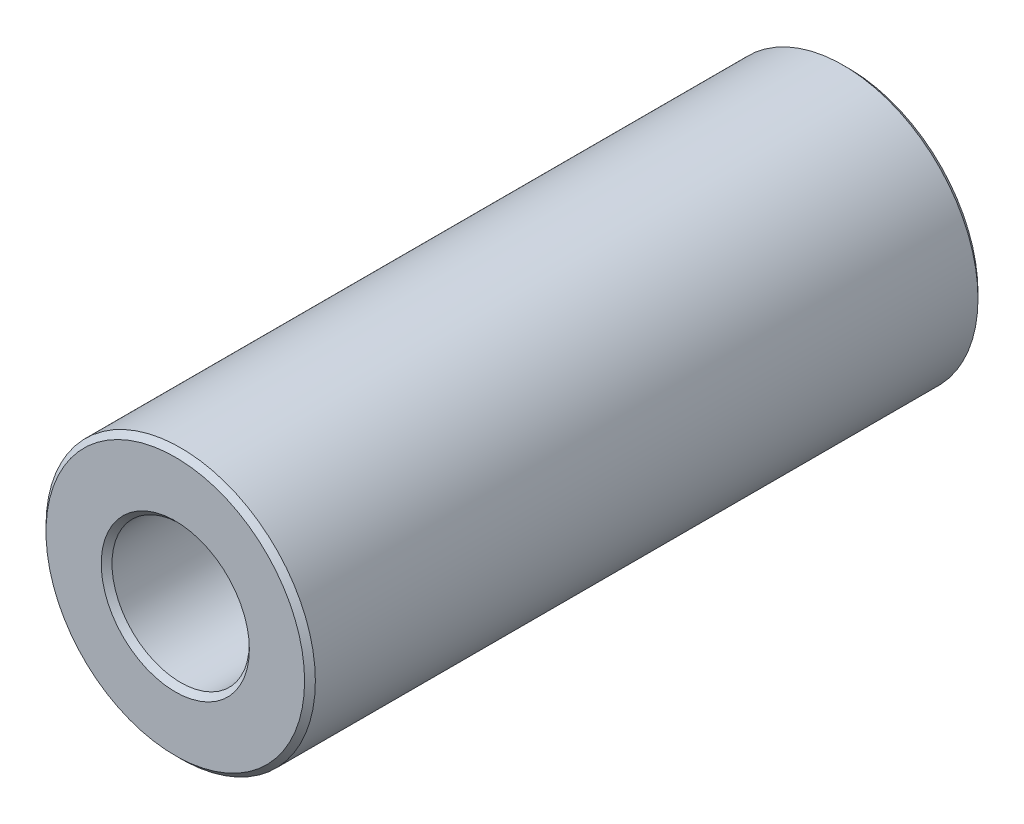
ISO-10303-21;
HEADER;
FILE_DESCRIPTION(('STEP AP214'),'2;1');
FILE_NAME('part.step','',(''),(''),'','','');
FILE_SCHEMA(('AUTOMOTIVE_DESIGN { 1 0 10303 214 1 1 1 1 }'));
ENDSEC;
DATA;
#1=APPLICATION_CONTEXT('core data for automotive mechanical design processes');
#2=APPLICATION_PROTOCOL_DEFINITION('international standard','automotive_design',2000,#1);
#3=PRODUCT_CONTEXT('',#1,'mechanical');
#4=PRODUCT('Part','Part','',(#3));
#5=PRODUCT_RELATED_PRODUCT_CATEGORY('part','',(#4));
#6=PRODUCT_DEFINITION_FORMATION('','',#4);
#7=PRODUCT_DEFINITION_CONTEXT('part definition',#1,'design');
#8=PRODUCT_DEFINITION('design','',#6,#7);
#9=PRODUCT_DEFINITION_SHAPE('','',#8);
#10=(LENGTH_UNIT() NAMED_UNIT(*) SI_UNIT(.MILLI.,.METRE.));
#11=(NAMED_UNIT(*) PLANE_ANGLE_UNIT() SI_UNIT($,.RADIAN.));
#12=(NAMED_UNIT(*) SI_UNIT($,.STERADIAN.) SOLID_ANGLE_UNIT());
#13=UNCERTAINTY_MEASURE_WITH_UNIT(LENGTH_MEASURE(1.E-05),#10,'distance_accuracy_value','');
#14=(GEOMETRIC_REPRESENTATION_CONTEXT(3) GLOBAL_UNCERTAINTY_ASSIGNED_CONTEXT((#13)) GLOBAL_UNIT_ASSIGNED_CONTEXT((#10,
#11,#12)) REPRESENTATION_CONTEXT('',''));
#15=CARTESIAN_POINT('',(0.,0.,0.));
#16=DIRECTION('',(0.,0.,1.));
#17=DIRECTION('',(1.,0.,0.));
#18=AXIS2_PLACEMENT_3D('',#15,#16,#17);
#19=CARTESIAN_POINT('',(0.,0.,25.));
#20=DIRECTION('',(0.,0.,1.));
#21=DIRECTION('',(1.,0.,0.));
#22=AXIS2_PLACEMENT_3D('',#19,#20,#21);
#23=PLANE('',#22);
#24=CARTESIAN_POINT('',(0.,0.,25.));
#25=DIRECTION('',(0.,0.,1.));
#26=DIRECTION('',(1.,0.,0.));
#27=AXIS2_PLACEMENT_3D('',#24,#25,#26);
#28=CIRCLE('',#27,2.75000000000001);
#29=CARTESIAN_POINT('',(2.75000000000001,0.,25.));
#30=VERTEX_POINT('',#29);
#31=EDGE_CURVE('E10',#30,#30,#28,.F.);
#32=ORIENTED_EDGE('',*,*,#31,.T.);
#33=EDGE_LOOP('',(#32));
#34=FACE_BOUND('',#33,.T.);
#35=CARTESIAN_POINT('',(0.,0.,25.));
#36=DIRECTION('',(0.,0.,1.));
#37=DIRECTION('',(1.,0.,0.));
#38=AXIS2_PLACEMENT_3D('',#35,#36,#37);
#39=CIRCLE('',#38,4.80000000000001);
#40=CARTESIAN_POINT('',(4.80000000000001,0.,25.));
#41=VERTEX_POINT('',#40);
#42=EDGE_CURVE('E37',#41,#41,#39,.T.);
#43=ORIENTED_EDGE('',*,*,#42,.T.);
#44=EDGE_LOOP('',(#43));
#45=FACE_BOUND('',#44,.T.);
#46=ADVANCED_FACE('F30',(#34,#45),#23,.T.);
#47=CARTESIAN_POINT('',(0.,0.,0.));
#48=DIRECTION('',(0.,0.,1.));
#49=DIRECTION('',(1.,0.,0.));
#50=AXIS2_PLACEMENT_3D('',#47,#48,#49);
#51=PLANE('',#50);
#52=CARTESIAN_POINT('',(0.,0.,0.));
#53=DIRECTION('',(0.,0.,1.));
#54=DIRECTION('',(1.,0.,0.));
#55=AXIS2_PLACEMENT_3D('',#52,#53,#54);
#56=CIRCLE('',#55,4.8);
#57=CARTESIAN_POINT('',(4.8,0.,0.));
#58=VERTEX_POINT('',#57);
#59=EDGE_CURVE('E50',#58,#58,#56,.F.);
#60=ORIENTED_EDGE('',*,*,#59,.T.);
#61=EDGE_LOOP('',(#60));
#62=FACE_BOUND('',#61,.T.);
#63=CARTESIAN_POINT('',(0.,0.,0.));
#64=DIRECTION('',(0.,0.,1.));
#65=DIRECTION('',(1.,0.,0.));
#66=AXIS2_PLACEMENT_3D('',#63,#64,#65);
#67=CIRCLE('',#66,2.75);
#68=CARTESIAN_POINT('',(2.75,0.,0.));
#69=VERTEX_POINT('',#68);
#70=EDGE_CURVE('E53',#69,#69,#67,.T.);
#71=ORIENTED_EDGE('',*,*,#70,.T.);
#72=EDGE_LOOP('',(#71));
#73=FACE_BOUND('',#72,.T.);
#74=ADVANCED_FACE('F74',(#62,#73),#51,.F.);
#75=CARTESIAN_POINT('',(0.,0.,25.));
#76=DIRECTION('',(0.,0.,-1.));
#77=DIRECTION('',(-1.,0.,0.));
#78=AXIS2_PLACEMENT_3D('',#75,#76,#77);
#79=CYLINDRICAL_SURFACE('',#78,5.);
#80=CARTESIAN_POINT('',(0.,0.,0.199999999999999));
#81=DIRECTION('',(0.,0.,1.));
#82=DIRECTION('',(1.,0.,0.));
#83=AXIS2_PLACEMENT_3D('',#80,#81,#82);
#84=CIRCLE('',#83,5.);
#85=CARTESIAN_POINT('',(5.,0.,0.199999999999999));
#86=VERTEX_POINT('',#85);
#87=EDGE_CURVE('E56',#86,#86,#84,.T.);
#88=ORIENTED_EDGE('',*,*,#87,.T.);
#89=EDGE_LOOP('',(#88));
#90=FACE_BOUND('',#89,.T.);
#91=CARTESIAN_POINT('',(0.,0.,24.8));
#92=DIRECTION('',(0.,0.,1.));
#93=DIRECTION('',(1.,0.,0.));
#94=AXIS2_PLACEMENT_3D('',#91,#92,#93);
#95=CIRCLE('',#94,5.);
#96=CARTESIAN_POINT('',(5.,0.,24.8));
#97=VERTEX_POINT('',#96);
#98=EDGE_CURVE('E59',#97,#97,#95,.F.);
#99=ORIENTED_EDGE('',*,*,#98,.T.);
#100=EDGE_LOOP('',(#99));
#101=FACE_BOUND('',#100,.T.);
#102=ADVANCED_FACE('F63',(#90,#101),#79,.T.);
#103=CARTESIAN_POINT('',(0.,0.,25.));
#104=DIRECTION('',(0.,0.,-1.));
#105=DIRECTION('',(-1.,0.,0.));
#106=AXIS2_PLACEMENT_3D('',#103,#104,#105);
#107=CYLINDRICAL_SURFACE('',#106,2.55);
#108=CARTESIAN_POINT('',(0.,0.,0.199999999999995));
#109=DIRECTION('',(0.,0.,1.));
#110=DIRECTION('',(1.,0.,0.));
#111=AXIS2_PLACEMENT_3D('',#108,#109,#110);
#112=CIRCLE('',#111,2.55);
#113=CARTESIAN_POINT('',(2.55,0.,0.199999999999995));
#114=VERTEX_POINT('',#113);
#115=EDGE_CURVE('E41',#114,#114,#112,.F.);
#116=ORIENTED_EDGE('',*,*,#115,.T.);
#117=EDGE_LOOP('',(#116));
#118=FACE_BOUND('',#117,.T.);
#119=CARTESIAN_POINT('',(0.,0.,24.8));
#120=DIRECTION('',(0.,0.,1.));
#121=DIRECTION('',(1.,0.,0.));
#122=AXIS2_PLACEMENT_3D('',#119,#120,#121);
#123=CIRCLE('',#122,2.55);
#124=CARTESIAN_POINT('',(2.55,0.,24.8));
#125=VERTEX_POINT('',#124);
#126=EDGE_CURVE('E45',#125,#125,#123,.T.);
#127=ORIENTED_EDGE('',*,*,#126,.T.);
#128=EDGE_LOOP('',(#127));
#129=FACE_BOUND('',#128,.T.);
#130=ADVANCED_FACE('F82',(#118,#129),#107,.F.);
#131=CARTESIAN_POINT('',(0.,0.,0.199999999999999));
#132=DIRECTION('',(0.,0.,1.));
#133=DIRECTION('',(1.,0.,0.));
#134=AXIS2_PLACEMENT_3D('',#131,#132,#133);
#135=CONICAL_SURFACE('',#134,5.,0.785398163397455);
#136=ORIENTED_EDGE('',*,*,#59,.F.);
#137=EDGE_LOOP('',(#136));
#138=FACE_BOUND('',#137,.T.);
#139=ORIENTED_EDGE('',*,*,#87,.F.);
#140=EDGE_LOOP('',(#139));
#141=FACE_BOUND('',#140,.T.);
#142=ADVANCED_FACE('F87',(#138,#141),#135,.T.);
#143=CARTESIAN_POINT('',(0.,0.,0.));
#144=DIRECTION('',(0.,0.,-1.));
#145=DIRECTION('',(-1.,0.,0.));
#146=AXIS2_PLACEMENT_3D('',#143,#144,#145);
#147=CONICAL_SURFACE('',#146,2.75,0.785398163397449);
#148=ORIENTED_EDGE('',*,*,#115,.F.);
#149=EDGE_LOOP('',(#148));
#150=FACE_BOUND('',#149,.T.);
#151=ORIENTED_EDGE('',*,*,#70,.F.);
#152=EDGE_LOOP('',(#151));
#153=FACE_BOUND('',#152,.T.);
#154=ADVANCED_FACE('F71',(#150,#153),#147,.F.);
#155=CARTESIAN_POINT('',(0.,0.,24.8));
#156=DIRECTION('',(0.,0.,1.));
#157=DIRECTION('',(1.,0.,0.));
#158=AXIS2_PLACEMENT_3D('',#155,#156,#157);
#159=CONICAL_SURFACE('',#158,2.55,0.785398163397458);
#160=ORIENTED_EDGE('',*,*,#31,.F.);
#161=EDGE_LOOP('',(#160));
#162=FACE_BOUND('',#161,.T.);
#163=ORIENTED_EDGE('',*,*,#126,.F.);
#164=EDGE_LOOP('',(#163));
#165=FACE_BOUND('',#164,.T.);
#166=ADVANCED_FACE('F67',(#162,#165),#159,.F.);
#167=CARTESIAN_POINT('',(0.,0.,25.));
#168=DIRECTION('',(0.,0.,-1.));
#169=DIRECTION('',(-1.,0.,0.));
#170=AXIS2_PLACEMENT_3D('',#167,#168,#169);
#171=CONICAL_SURFACE('',#170,4.80000000000001,0.785398163397438);
#172=ORIENTED_EDGE('',*,*,#98,.F.);
#173=EDGE_LOOP('',(#172));
#174=FACE_BOUND('',#173,.T.);
#175=ORIENTED_EDGE('',*,*,#42,.F.);
#176=EDGE_LOOP('',(#175));
#177=FACE_BOUND('',#176,.T.);
#178=ADVANCED_FACE('F32',(#174,#177),#171,.T.);
#179=CLOSED_SHELL('',(#46,#74,#102,#130,#142,#154,#166,#178));
#180=MANIFOLD_SOLID_BREP('B2',#179);
#181=ADVANCED_BREP_SHAPE_REPRESENTATION('',(#18,#180),#14);
#182=SHAPE_DEFINITION_REPRESENTATION(#9,#181);
ENDSEC;
END-ISO-10303-21;
